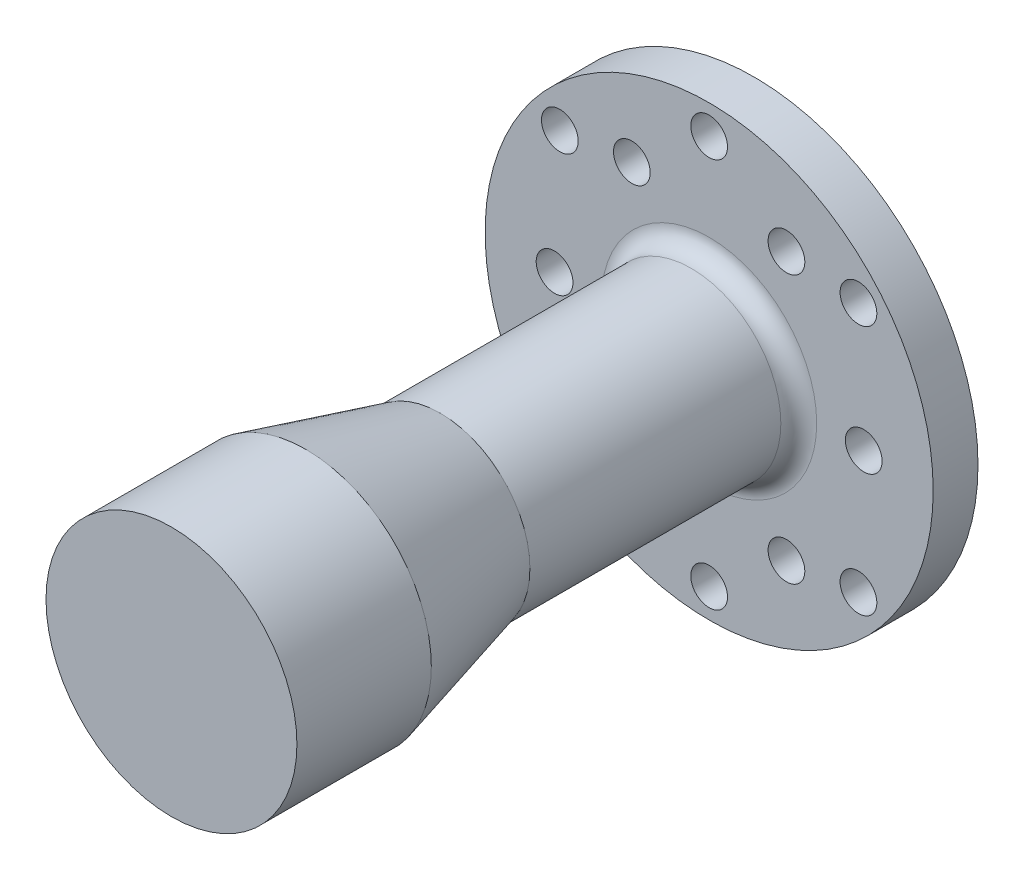
ISO-10303-21;
HEADER;
FILE_DESCRIPTION(('STEP AP214'),'2;1');
FILE_NAME('part.step','',(''),(''),'','','');
FILE_SCHEMA(('AUTOMOTIVE_DESIGN { 1 0 10303 214 1 1 1 1 }'));
ENDSEC;
DATA;
#1=APPLICATION_CONTEXT('core data for automotive mechanical design processes');
#2=APPLICATION_PROTOCOL_DEFINITION('international standard','automotive_design',2000,#1);
#3=PRODUCT_CONTEXT('',#1,'mechanical');
#4=PRODUCT('Part','Part','',(#3));
#5=PRODUCT_RELATED_PRODUCT_CATEGORY('part','',(#4));
#6=PRODUCT_DEFINITION_FORMATION('','',#4);
#7=PRODUCT_DEFINITION_CONTEXT('part definition',#1,'design');
#8=PRODUCT_DEFINITION('design','',#6,#7);
#9=PRODUCT_DEFINITION_SHAPE('','',#8);
#10=(LENGTH_UNIT() NAMED_UNIT(*) SI_UNIT(.MILLI.,.METRE.));
#11=(NAMED_UNIT(*) PLANE_ANGLE_UNIT() SI_UNIT($,.RADIAN.));
#12=(NAMED_UNIT(*) SI_UNIT($,.STERADIAN.) SOLID_ANGLE_UNIT());
#13=UNCERTAINTY_MEASURE_WITH_UNIT(LENGTH_MEASURE(1.E-05),#10,'distance_accuracy_value','');
#14=(GEOMETRIC_REPRESENTATION_CONTEXT(3) GLOBAL_UNCERTAINTY_ASSIGNED_CONTEXT((#13)) GLOBAL_UNIT_ASSIGNED_CONTEXT((#10,
#11,#12)) REPRESENTATION_CONTEXT('',''));
#15=CARTESIAN_POINT('',(0.,0.,0.));
#16=DIRECTION('',(0.,0.,1.));
#17=DIRECTION('',(1.,0.,0.));
#18=AXIS2_PLACEMENT_3D('',#15,#16,#17);
#19=CARTESIAN_POINT('',(0.,0.,65.));
#20=DIRECTION('',(0.,0.,-1.));
#21=DIRECTION('',(-1.,0.,0.));
#22=AXIS2_PLACEMENT_3D('',#19,#20,#21);
#23=CYLINDRICAL_SURFACE('',#22,10.);
#24=CARTESIAN_POINT('',(0.,0.,35.0000000000006));
#25=DIRECTION('',(0.,0.,1.));
#26=DIRECTION('',(1.,0.,0.));
#27=AXIS2_PLACEMENT_3D('',#24,#25,#26);
#28=CIRCLE('',#27,10.);
#29=CARTESIAN_POINT('',(-10.,0.,35.0000000000006));
#30=VERTEX_POINT('',#29);
#31=EDGE_CURVE('E10',#30,#30,#28,.F.);
#32=CARTESIAN_POINT('',(0.,0.,7.));
#33=DIRECTION('',(0.,0.,1.));
#34=DIRECTION('',(1.,0.,0.));
#35=AXIS2_PLACEMENT_3D('',#32,#33,#34);
#36=CIRCLE('',#35,10.);
#37=CARTESIAN_POINT('',(-10.,0.,7.));
#38=VERTEX_POINT('',#37);
#39=EDGE_CURVE('E51',#38,#38,#36,.T.);
#40=CARTESIAN_POINT('',(-10.,0.,35.0000000000006));
#41=CARTESIAN_POINT('',(-10.,0.,34.7083333333339));
#42=CARTESIAN_POINT('',(-10.,0.,34.4166666666673));
#43=CARTESIAN_POINT('',(-10.,0.,33.8333333333339));
#44=CARTESIAN_POINT('',(-10.,0.,33.5416666666672));
#45=CARTESIAN_POINT('',(-10.,0.,32.9583333333339));
#46=CARTESIAN_POINT('',(-10.,0.,32.6666666666672));
#47=CARTESIAN_POINT('',(-10.,0.,32.0833333333339));
#48=CARTESIAN_POINT('',(-10.,0.,31.7916666666672));
#49=CARTESIAN_POINT('',(-10.,0.,31.2083333333339));
#50=CARTESIAN_POINT('',(-10.,0.,30.9166666666672));
#51=CARTESIAN_POINT('',(-10.,0.,30.3333333333338));
#52=CARTESIAN_POINT('',(-10.,0.,30.0416666666672));
#53=CARTESIAN_POINT('',(-10.,0.,29.4583333333338));
#54=CARTESIAN_POINT('',(-10.,0.,29.1666666666671));
#55=CARTESIAN_POINT('',(-10.,0.,28.5833333333338));
#56=CARTESIAN_POINT('',(-10.,0.,28.2916666666671));
#57=CARTESIAN_POINT('',(-10.,0.,27.7083333333338));
#58=CARTESIAN_POINT('',(-10.,0.,27.4166666666671));
#59=CARTESIAN_POINT('',(-10.,0.,26.8333333333338));
#60=CARTESIAN_POINT('',(-10.,0.,26.5416666666671));
#61=CARTESIAN_POINT('',(-10.,0.,25.9583333333337));
#62=CARTESIAN_POINT('',(-10.,0.,25.6666666666671));
#63=CARTESIAN_POINT('',(-10.,0.,25.0833333333337));
#64=CARTESIAN_POINT('',(-10.,0.,24.791666666667));
#65=CARTESIAN_POINT('',(-10.,0.,24.2083333333337));
#66=CARTESIAN_POINT('',(-10.,0.,23.916666666667));
#67=CARTESIAN_POINT('',(-10.,0.,23.3333333333337));
#68=CARTESIAN_POINT('',(-10.,0.,23.041666666667));
#69=CARTESIAN_POINT('',(-10.,0.,22.4583333333337));
#70=CARTESIAN_POINT('',(-10.,0.,22.166666666667));
#71=CARTESIAN_POINT('',(-10.,0.,21.5833333333336));
#72=CARTESIAN_POINT('',(-10.,0.,21.291666666667));
#73=CARTESIAN_POINT('',(-10.,0.,20.7083333333336));
#74=CARTESIAN_POINT('',(-10.,0.,20.416666666667));
#75=CARTESIAN_POINT('',(-10.,0.,19.8333333333336));
#76=CARTESIAN_POINT('',(-10.,0.,19.5416666666669));
#77=CARTESIAN_POINT('',(-10.,0.,18.9583333333336));
#78=CARTESIAN_POINT('',(-10.,0.,18.6666666666669));
#79=CARTESIAN_POINT('',(-10.,0.,18.0833333333336));
#80=CARTESIAN_POINT('',(-10.,0.,17.7916666666669));
#81=CARTESIAN_POINT('',(-10.,0.,17.2083333333336));
#82=CARTESIAN_POINT('',(-10.,0.,16.9166666666669));
#83=CARTESIAN_POINT('',(-10.,0.,16.3333333333335));
#84=CARTESIAN_POINT('',(-10.,0.,16.0416666666669));
#85=CARTESIAN_POINT('',(-10.,0.,15.4583333333335));
#86=CARTESIAN_POINT('',(-10.,0.,15.1666666666668));
#87=CARTESIAN_POINT('',(-10.,0.,14.5833333333335));
#88=CARTESIAN_POINT('',(-10.,0.,14.2916666666668));
#89=CARTESIAN_POINT('',(-10.,0.,13.7083333333335));
#90=CARTESIAN_POINT('',(-10.,0.,13.4166666666668));
#91=CARTESIAN_POINT('',(-10.,0.,12.8333333333335));
#92=CARTESIAN_POINT('',(-10.,0.,12.5416666666668));
#93=CARTESIAN_POINT('',(-10.,0.,11.9583333333334));
#94=CARTESIAN_POINT('',(-10.,0.,11.6666666666668));
#95=CARTESIAN_POINT('',(-10.,0.,11.0833333333334));
#96=CARTESIAN_POINT('',(-10.,0.,10.7916666666667));
#97=CARTESIAN_POINT('',(-10.,0.,10.2083333333334));
#98=CARTESIAN_POINT('',(-10.,0.,9.91666666666673));
#99=CARTESIAN_POINT('',(-10.,0.,9.33333333333338));
#100=CARTESIAN_POINT('',(-10.,0.,9.04166666666671));
#101=CARTESIAN_POINT('',(-10.,0.,8.45833333333336));
#102=CARTESIAN_POINT('',(-10.,0.,8.16666666666669));
#103=CARTESIAN_POINT('',(-10.,0.,7.58333333333334));
#104=CARTESIAN_POINT('',(-10.,0.,7.29166666666667));
#105=CARTESIAN_POINT('',(-10.,0.,7.));
#106=B_SPLINE_CURVE_WITH_KNOTS('',3,(#40,#41,#42,#43,#44,#45,#46,#47,#48,#49,#50,#51,#52,#53,
#54,#55,#56,#57,#58,#59,#60,#61,#62,#63,#64,#65,#66,#67,#68,#69,#70,#71,#72,#73,#74,#75,#76,#77,
#78,#79,#80,#81,#82,#83,#84,#85,#86,#87,#88,#89,#90,#91,#92,#93,#94,#95,#96,#97,#98,#99,#100,
#101,#102,#103,#104,#105),.UNSPECIFIED.,.F.,.F.,(4,2,2,2,2,2,2,2,2,2,2,2,2,2,2,2,2,2,2,2,2,2,2,
2,2,2,2,2,2,2,2,2,4),(0.,0.875000000000022,1.75000000000004,2.62500000000006,3.50000000000007,
4.37500000000009,5.25000000000011,6.12500000000013,7.00000000000015,7.87500000000017,
8.75000000000019,9.62500000000021,10.5000000000002,11.3750000000002,12.2500000000003,
13.1250000000003,14.0000000000003,14.8750000000003,15.7500000000003,16.6250000000004,
17.5000000000004,18.3750000000004,19.2500000000004,20.1250000000004,21.0000000000004,
21.8750000000005,22.7500000000005,23.6250000000005,24.5000000000005,25.3750000000005,
26.2500000000006,27.1250000000006,28.0000000000006),.UNSPECIFIED.);
#107=EDGE_CURVE('BSEAM39',#30,#38,#106,.T.);
#108=ORIENTED_EDGE('',*,*,#31,.T.);
#109=ORIENTED_EDGE('',*,*,#39,.T.);
#110=ORIENTED_EDGE('',*,*,#107,.T.);
#111=ORIENTED_EDGE('',*,*,#107,.F.);
#112=EDGE_LOOP('',(#108,#110,#109,#111));
#113=FACE_BOUND('',#112,.T.);
#114=ADVANCED_FACE('F39',(#113),#23,.T.);
#115=CARTESIAN_POINT('',(0.,0.,5.));
#116=DIRECTION('',(0.,0.,1.));
#117=DIRECTION('',(1.,0.,0.));
#118=AXIS2_PLACEMENT_3D('',#115,#116,#117);
#119=PLANE('',#118);
#120=CARTESIAN_POINT('',(0.,0.,5.));
#121=DIRECTION('',(0.,0.,1.));
#122=DIRECTION('',(1.,0.,0.));
#123=AXIS2_PLACEMENT_3D('',#120,#121,#122);
#124=CIRCLE('',#123,12.);
#125=CARTESIAN_POINT('',(12.,0.,5.));
#126=VERTEX_POINT('',#125);
#127=EDGE_CURVE('E47',#126,#126,#124,.F.);
#128=ORIENTED_EDGE('',*,*,#127,.T.);
#129=EDGE_LOOP('',(#128));
#130=FACE_BOUND('',#129,.T.);
#131=CARTESIAN_POINT('',(-17.25,0.,5.));
#132=DIRECTION('',(0.,0.,1.));
#133=DIRECTION('',(1.,0.,0.));
#134=AXIS2_PLACEMENT_3D('',#131,#132,#133);
#135=CIRCLE('',#134,2.05);
#136=CARTESIAN_POINT('',(-15.2,0.,5.));
#137=VERTEX_POINT('',#136);
#138=EDGE_CURVE('E121',#137,#137,#135,.T.);
#139=ORIENTED_EDGE('',*,*,#138,.F.);
#140=EDGE_LOOP('',(#139));
#141=FACE_BOUND('',#140,.T.);
#142=CARTESIAN_POINT('',(8.62499999999998,-14.9389382152816,5.));
#143=DIRECTION('',(0.,0.,1.));
#144=DIRECTION('',(1.,0.,0.));
#145=AXIS2_PLACEMENT_3D('',#142,#143,#144);
#146=CIRCLE('',#145,2.05);
#147=CARTESIAN_POINT('',(10.675,-14.9389382152816,5.));
#148=VERTEX_POINT('',#147);
#149=EDGE_CURVE('E109',#148,#148,#146,.T.);
#150=ORIENTED_EDGE('',*,*,#149,.F.);
#151=EDGE_LOOP('',(#150));
#152=FACE_BOUND('',#151,.T.);
#153=CARTESIAN_POINT('',(8.62500000000001,14.9389382152816,5.));
#154=DIRECTION('',(0.,0.,1.));
#155=DIRECTION('',(1.,0.,0.));
#156=AXIS2_PLACEMENT_3D('',#153,#154,#155);
#157=CIRCLE('',#156,2.05);
#158=CARTESIAN_POINT('',(10.675,14.9389382152816,5.));
#159=VERTEX_POINT('',#158);
#160=EDGE_CURVE('E97',#159,#159,#157,.T.);
#161=ORIENTED_EDGE('',*,*,#160,.F.);
#162=EDGE_LOOP('',(#161));
#163=FACE_BOUND('',#162,.T.);
#164=CARTESIAN_POINT('',(0.,-21.75,5.));
#165=DIRECTION('',(0.,0.,1.));
#166=DIRECTION('',(-1.,0.,0.));
#167=AXIS2_PLACEMENT_3D('',#164,#165,#166);
#168=CIRCLE('',#167,2.05);
#169=CARTESIAN_POINT('',(-2.05,-21.75,5.));
#170=VERTEX_POINT('',#169);
#171=EDGE_CURVE('E85',#170,#170,#168,.T.);
#172=ORIENTED_EDGE('',*,*,#171,.F.);
#173=EDGE_LOOP('',(#172));
#174=FACE_BOUND('',#173,.T.);
#175=CARTESIAN_POINT('',(-16.6614666378377,13.9806305106823,5.));
#176=DIRECTION('',(0.,0.,1.));
#177=DIRECTION('',(1.,0.,0.));
#178=AXIS2_PLACEMENT_3D('',#175,#176,#177);
#179=CIRCLE('',#178,2.05);
#180=CARTESIAN_POINT('',(-14.6114666378377,13.9806305106823,5.));
#181=VERTEX_POINT('',#180);
#182=EDGE_CURVE('E73',#181,#181,#179,.T.);
#183=ORIENTED_EDGE('',*,*,#182,.F.);
#184=EDGE_LOOP('',(#183));
#185=FACE_BOUND('',#184,.T.);
#186=CARTESIAN_POINT('',(16.6614666378377,13.9806305106823,5.));
#187=DIRECTION('',(0.,0.,1.));
#188=DIRECTION('',(1.,0.,0.));
#189=AXIS2_PLACEMENT_3D('',#186,#187,#188);
#190=CIRCLE('',#189,2.05);
#191=CARTESIAN_POINT('',(18.7114666378377,13.9806305106823,5.));
#192=VERTEX_POINT('',#191);
#193=EDGE_CURVE('E61',#192,#192,#190,.T.);
#194=ORIENTED_EDGE('',*,*,#193,.F.);
#195=EDGE_LOOP('',(#194));
#196=FACE_BOUND('',#195,.T.);
#197=CARTESIAN_POINT('',(0.,0.,5.));
#198=DIRECTION('',(0.,0.,1.));
#199=DIRECTION('',(1.,0.,0.));
#200=AXIS2_PLACEMENT_3D('',#197,#198,#199);
#201=CIRCLE('',#200,25.);
#202=CARTESIAN_POINT('',(25.,0.,5.));
#203=VERTEX_POINT('',#202);
#204=EDGE_CURVE('E55',#203,#203,#201,.T.);
#205=ORIENTED_EDGE('',*,*,#204,.T.);
#206=EDGE_LOOP('',(#205));
#207=FACE_BOUND('',#206,.T.);
#208=CARTESIAN_POINT('',(0.,21.75,5.));
#209=DIRECTION('',(0.,0.,1.));
#210=DIRECTION('',(1.,0.,0.));
#211=AXIS2_PLACEMENT_3D('',#208,#209,#210);
#212=CIRCLE('',#211,2.05);
#213=CARTESIAN_POINT('',(2.05,21.75,5.));
#214=VERTEX_POINT('',#213);
#215=EDGE_CURVE('E67',#214,#214,#212,.T.);
#216=ORIENTED_EDGE('',*,*,#215,.F.);
#217=EDGE_LOOP('',(#216));
#218=FACE_BOUND('',#217,.T.);
#219=CARTESIAN_POINT('',(16.6614666378377,-13.9806305106823,5.));
#220=DIRECTION('',(0.,0.,1.));
#221=DIRECTION('',(-1.,0.,0.));
#222=AXIS2_PLACEMENT_3D('',#219,#220,#221);
#223=CIRCLE('',#222,2.05);
#224=CARTESIAN_POINT('',(14.6114666378377,-13.9806305106823,5.));
#225=VERTEX_POINT('',#224);
#226=EDGE_CURVE('E79',#225,#225,#223,.T.);
#227=ORIENTED_EDGE('',*,*,#226,.F.);
#228=EDGE_LOOP('',(#227));
#229=FACE_BOUND('',#228,.T.);
#230=CARTESIAN_POINT('',(-16.6614666378377,-13.9806305106823,5.));
#231=DIRECTION('',(0.,0.,1.));
#232=DIRECTION('',(-1.,0.,0.));
#233=AXIS2_PLACEMENT_3D('',#230,#231,#232);
#234=CIRCLE('',#233,2.05);
#235=CARTESIAN_POINT('',(-18.7114666378377,-13.9806305106823,5.));
#236=VERTEX_POINT('',#235);
#237=EDGE_CURVE('E91',#236,#236,#234,.T.);
#238=ORIENTED_EDGE('',*,*,#237,.F.);
#239=EDGE_LOOP('',(#238));
#240=FACE_BOUND('',#239,.T.);
#241=CARTESIAN_POINT('',(17.25,0.,5.));
#242=DIRECTION('',(0.,0.,1.));
#243=DIRECTION('',(1.,0.,0.));
#244=AXIS2_PLACEMENT_3D('',#241,#242,#243);
#245=CIRCLE('',#244,2.05);
#246=CARTESIAN_POINT('',(19.3,0.,5.));
#247=VERTEX_POINT('',#246);
#248=EDGE_CURVE('E103',#247,#247,#245,.T.);
#249=ORIENTED_EDGE('',*,*,#248,.F.);
#250=EDGE_LOOP('',(#249));
#251=FACE_BOUND('',#250,.T.);
#252=CARTESIAN_POINT('',(-8.62500000000003,-14.9389382152815,5.));
#253=DIRECTION('',(0.,0.,1.));
#254=DIRECTION('',(1.,0.,0.));
#255=AXIS2_PLACEMENT_3D('',#252,#253,#254);
#256=CIRCLE('',#255,2.05);
#257=CARTESIAN_POINT('',(-6.57500000000003,-14.9389382152815,5.));
#258=VERTEX_POINT('',#257);
#259=EDGE_CURVE('E115',#258,#258,#256,.T.);
#260=ORIENTED_EDGE('',*,*,#259,.F.);
#261=EDGE_LOOP('',(#260));
#262=FACE_BOUND('',#261,.T.);
#263=CARTESIAN_POINT('',(-8.62500000000001,14.9389382152816,5.));
#264=DIRECTION('',(0.,0.,1.));
#265=DIRECTION('',(1.,0.,0.));
#266=AXIS2_PLACEMENT_3D('',#263,#264,#265);
#267=CIRCLE('',#266,2.05);
#268=CARTESIAN_POINT('',(-6.57500000000001,14.9389382152816,5.));
#269=VERTEX_POINT('',#268);
#270=EDGE_CURVE('E127',#269,#269,#267,.T.);
#271=ORIENTED_EDGE('',*,*,#270,.F.);
#272=EDGE_LOOP('',(#271));
#273=FACE_BOUND('',#272,.T.);
#274=ADVANCED_FACE('F154',(#130,#141,#152,#163,#174,#185,#196,#207,#218,#229,#240,#251,#262,
#273),#119,.T.);
#275=CARTESIAN_POINT('',(0.,0.,0.));
#276=DIRECTION('',(0.,0.,1.));
#277=DIRECTION('',(1.,0.,0.));
#278=AXIS2_PLACEMENT_3D('',#275,#276,#277);
#279=PLANE('',#278);
#280=CARTESIAN_POINT('',(0.,0.,0.));
#281=DIRECTION('',(0.,0.,1.));
#282=DIRECTION('',(1.,0.,0.));
#283=AXIS2_PLACEMENT_3D('',#280,#281,#282);
#284=CIRCLE('',#283,25.);
#285=CARTESIAN_POINT('',(25.,0.,0.));
#286=VERTEX_POINT('',#285);
#287=EDGE_CURVE('E58',#286,#286,#284,.T.);
#288=ORIENTED_EDGE('',*,*,#287,.F.);
#289=EDGE_LOOP('',(#288));
#290=FACE_BOUND('',#289,.T.);
#291=CARTESIAN_POINT('',(16.6614666378377,13.9806305106823,0.));
#292=DIRECTION('',(0.,0.,1.));
#293=DIRECTION('',(1.,0.,0.));
#294=AXIS2_PLACEMENT_3D('',#291,#292,#293);
#295=CIRCLE('',#294,2.05);
#296=CARTESIAN_POINT('',(18.7114666378377,13.9806305106823,0.));
#297=VERTEX_POINT('',#296);
#298=EDGE_CURVE('E64',#297,#297,#295,.T.);
#299=ORIENTED_EDGE('',*,*,#298,.T.);
#300=EDGE_LOOP('',(#299));
#301=FACE_BOUND('',#300,.T.);
#302=CARTESIAN_POINT('',(0.,21.75,0.));
#303=DIRECTION('',(0.,0.,1.));
#304=DIRECTION('',(1.,0.,0.));
#305=AXIS2_PLACEMENT_3D('',#302,#303,#304);
#306=CIRCLE('',#305,2.05);
#307=CARTESIAN_POINT('',(2.05,21.75,0.));
#308=VERTEX_POINT('',#307);
#309=EDGE_CURVE('E70',#308,#308,#306,.T.);
#310=ORIENTED_EDGE('',*,*,#309,.T.);
#311=EDGE_LOOP('',(#310));
#312=FACE_BOUND('',#311,.T.);
#313=CARTESIAN_POINT('',(-16.6614666378377,13.9806305106823,0.));
#314=DIRECTION('',(0.,0.,1.));
#315=DIRECTION('',(1.,0.,0.));
#316=AXIS2_PLACEMENT_3D('',#313,#314,#315);
#317=CIRCLE('',#316,2.05);
#318=CARTESIAN_POINT('',(-14.6114666378377,13.9806305106823,0.));
#319=VERTEX_POINT('',#318);
#320=EDGE_CURVE('E76',#319,#319,#317,.T.);
#321=ORIENTED_EDGE('',*,*,#320,.T.);
#322=EDGE_LOOP('',(#321));
#323=FACE_BOUND('',#322,.T.);
#324=CARTESIAN_POINT('',(16.6614666378377,-13.9806305106823,0.));
#325=DIRECTION('',(0.,0.,1.));
#326=DIRECTION('',(-1.,0.,0.));
#327=AXIS2_PLACEMENT_3D('',#324,#325,#326);
#328=CIRCLE('',#327,2.05);
#329=CARTESIAN_POINT('',(14.6114666378377,-13.9806305106823,0.));
#330=VERTEX_POINT('',#329);
#331=EDGE_CURVE('E82',#330,#330,#328,.T.);
#332=ORIENTED_EDGE('',*,*,#331,.T.);
#333=EDGE_LOOP('',(#332));
#334=FACE_BOUND('',#333,.T.);
#335=CARTESIAN_POINT('',(0.,-21.75,0.));
#336=DIRECTION('',(0.,0.,1.));
#337=DIRECTION('',(-1.,0.,0.));
#338=AXIS2_PLACEMENT_3D('',#335,#336,#337);
#339=CIRCLE('',#338,2.05);
#340=CARTESIAN_POINT('',(-2.05,-21.75,0.));
#341=VERTEX_POINT('',#340);
#342=EDGE_CURVE('E88',#341,#341,#339,.T.);
#343=ORIENTED_EDGE('',*,*,#342,.T.);
#344=EDGE_LOOP('',(#343));
#345=FACE_BOUND('',#344,.T.);
#346=CARTESIAN_POINT('',(-16.6614666378377,-13.9806305106823,0.));
#347=DIRECTION('',(0.,0.,1.));
#348=DIRECTION('',(-1.,0.,0.));
#349=AXIS2_PLACEMENT_3D('',#346,#347,#348);
#350=CIRCLE('',#349,2.05);
#351=CARTESIAN_POINT('',(-18.7114666378377,-13.9806305106823,0.));
#352=VERTEX_POINT('',#351);
#353=EDGE_CURVE('E94',#352,#352,#350,.T.);
#354=ORIENTED_EDGE('',*,*,#353,.T.);
#355=EDGE_LOOP('',(#354));
#356=FACE_BOUND('',#355,.T.);
#357=CARTESIAN_POINT('',(8.62500000000001,14.9389382152816,0.));
#358=DIRECTION('',(0.,0.,1.));
#359=DIRECTION('',(1.,0.,0.));
#360=AXIS2_PLACEMENT_3D('',#357,#358,#359);
#361=CIRCLE('',#360,2.05);
#362=CARTESIAN_POINT('',(10.675,14.9389382152816,0.));
#363=VERTEX_POINT('',#362);
#364=EDGE_CURVE('E100',#363,#363,#361,.T.);
#365=ORIENTED_EDGE('',*,*,#364,.T.);
#366=EDGE_LOOP('',(#365));
#367=FACE_BOUND('',#366,.T.);
#368=CARTESIAN_POINT('',(17.25,0.,0.));
#369=DIRECTION('',(0.,0.,1.));
#370=DIRECTION('',(1.,0.,0.));
#371=AXIS2_PLACEMENT_3D('',#368,#369,#370);
#372=CIRCLE('',#371,2.05);
#373=CARTESIAN_POINT('',(19.3,0.,0.));
#374=VERTEX_POINT('',#373);
#375=EDGE_CURVE('E106',#374,#374,#372,.T.);
#376=ORIENTED_EDGE('',*,*,#375,.T.);
#377=EDGE_LOOP('',(#376));
#378=FACE_BOUND('',#377,.T.);
#379=CARTESIAN_POINT('',(8.62499999999998,-14.9389382152816,0.));
#380=DIRECTION('',(0.,0.,1.));
#381=DIRECTION('',(1.,0.,0.));
#382=AXIS2_PLACEMENT_3D('',#379,#380,#381);
#383=CIRCLE('',#382,2.05);
#384=CARTESIAN_POINT('',(10.675,-14.9389382152816,0.));
#385=VERTEX_POINT('',#384);
#386=EDGE_CURVE('E112',#385,#385,#383,.T.);
#387=ORIENTED_EDGE('',*,*,#386,.T.);
#388=EDGE_LOOP('',(#387));
#389=FACE_BOUND('',#388,.T.);
#390=CARTESIAN_POINT('',(-8.62500000000003,-14.9389382152815,0.));
#391=DIRECTION('',(0.,0.,1.));
#392=DIRECTION('',(1.,0.,0.));
#393=AXIS2_PLACEMENT_3D('',#390,#391,#392);
#394=CIRCLE('',#393,2.05);
#395=CARTESIAN_POINT('',(-6.57500000000003,-14.9389382152815,0.));
#396=VERTEX_POINT('',#395);
#397=EDGE_CURVE('E118',#396,#396,#394,.T.);
#398=ORIENTED_EDGE('',*,*,#397,.T.);
#399=EDGE_LOOP('',(#398));
#400=FACE_BOUND('',#399,.T.);
#401=CARTESIAN_POINT('',(-17.25,0.,0.));
#402=DIRECTION('',(0.,0.,1.));
#403=DIRECTION('',(1.,0.,0.));
#404=AXIS2_PLACEMENT_3D('',#401,#402,#403);
#405=CIRCLE('',#404,2.05);
#406=CARTESIAN_POINT('',(-15.2,0.,0.));
#407=VERTEX_POINT('',#406);
#408=EDGE_CURVE('E124',#407,#407,#405,.T.);
#409=ORIENTED_EDGE('',*,*,#408,.T.);
#410=EDGE_LOOP('',(#409));
#411=FACE_BOUND('',#410,.T.);
#412=CARTESIAN_POINT('',(-8.62500000000001,14.9389382152816,0.));
#413=DIRECTION('',(0.,0.,1.));
#414=DIRECTION('',(1.,0.,0.));
#415=AXIS2_PLACEMENT_3D('',#412,#413,#414);
#416=CIRCLE('',#415,2.05);
#417=CARTESIAN_POINT('',(-6.57500000000001,14.9389382152816,0.));
#418=VERTEX_POINT('',#417);
#419=EDGE_CURVE('E130',#418,#418,#416,.T.);
#420=ORIENTED_EDGE('',*,*,#419,.T.);
#421=EDGE_LOOP('',(#420));
#422=FACE_BOUND('',#421,.T.);
#423=ADVANCED_FACE('F160',(#290,#301,#312,#323,#334,#345,#356,#367,#378,#389,#400,#411,#422),
#279,.F.);
#424=CARTESIAN_POINT('',(0.,0.,5.));
#425=DIRECTION('',(0.,0.,-1.));
#426=DIRECTION('',(-1.,0.,0.));
#427=AXIS2_PLACEMENT_3D('',#424,#425,#426);
#428=CYLINDRICAL_SURFACE('',#427,25.);
#429=ORIENTED_EDGE('',*,*,#204,.F.);
#430=EDGE_LOOP('',(#429));
#431=FACE_BOUND('',#430,.T.);
#432=ORIENTED_EDGE('',*,*,#287,.T.);
#433=EDGE_LOOP('',(#432));
#434=FACE_BOUND('',#433,.T.);
#435=ADVANCED_FACE('F212',(#431,#434),#428,.T.);
#436=CARTESIAN_POINT('',(16.6614666378377,13.9806305106823,5.));
#437=DIRECTION('',(0.,0.,-1.));
#438=DIRECTION('',(-1.,0.,0.));
#439=AXIS2_PLACEMENT_3D('',#436,#437,#438);
#440=CYLINDRICAL_SURFACE('',#439,2.05);
#441=ORIENTED_EDGE('',*,*,#193,.T.);
#442=EDGE_LOOP('',(#441));
#443=FACE_BOUND('',#442,.T.);
#444=ORIENTED_EDGE('',*,*,#298,.F.);
#445=EDGE_LOOP('',(#444));
#446=FACE_BOUND('',#445,.T.);
#447=ADVANCED_FACE('F209',(#443,#446),#440,.F.);
#448=CARTESIAN_POINT('',(0.,21.75,5.));
#449=DIRECTION('',(0.,0.,-1.));
#450=DIRECTION('',(-1.,0.,0.));
#451=AXIS2_PLACEMENT_3D('',#448,#449,#450);
#452=CYLINDRICAL_SURFACE('',#451,2.05);
#453=ORIENTED_EDGE('',*,*,#215,.T.);
#454=EDGE_LOOP('',(#453));
#455=FACE_BOUND('',#454,.T.);
#456=ORIENTED_EDGE('',*,*,#309,.F.);
#457=EDGE_LOOP('',(#456));
#458=FACE_BOUND('',#457,.T.);
#459=ADVANCED_FACE('F205',(#455,#458),#452,.F.);
#460=CARTESIAN_POINT('',(-16.6614666378377,13.9806305106823,5.));
#461=DIRECTION('',(0.,0.,-1.));
#462=DIRECTION('',(-1.,0.,0.));
#463=AXIS2_PLACEMENT_3D('',#460,#461,#462);
#464=CYLINDRICAL_SURFACE('',#463,2.05);
#465=ORIENTED_EDGE('',*,*,#182,.T.);
#466=EDGE_LOOP('',(#465));
#467=FACE_BOUND('',#466,.T.);
#468=ORIENTED_EDGE('',*,*,#320,.F.);
#469=EDGE_LOOP('',(#468));
#470=FACE_BOUND('',#469,.T.);
#471=ADVANCED_FACE('F201',(#467,#470),#464,.F.);
#472=CARTESIAN_POINT('',(16.6614666378377,-13.9806305106823,5.));
#473=DIRECTION('',(0.,0.,-1.));
#474=DIRECTION('',(-1.,0.,0.));
#475=AXIS2_PLACEMENT_3D('',#472,#473,#474);
#476=CYLINDRICAL_SURFACE('',#475,2.05);
#477=ORIENTED_EDGE('',*,*,#226,.T.);
#478=EDGE_LOOP('',(#477));
#479=FACE_BOUND('',#478,.T.);
#480=ORIENTED_EDGE('',*,*,#331,.F.);
#481=EDGE_LOOP('',(#480));
#482=FACE_BOUND('',#481,.T.);
#483=ADVANCED_FACE('F197',(#479,#482),#476,.F.);
#484=CARTESIAN_POINT('',(0.,-21.75,5.));
#485=DIRECTION('',(0.,0.,-1.));
#486=DIRECTION('',(-1.,0.,0.));
#487=AXIS2_PLACEMENT_3D('',#484,#485,#486);
#488=CYLINDRICAL_SURFACE('',#487,2.05);
#489=ORIENTED_EDGE('',*,*,#171,.T.);
#490=EDGE_LOOP('',(#489));
#491=FACE_BOUND('',#490,.T.);
#492=ORIENTED_EDGE('',*,*,#342,.F.);
#493=EDGE_LOOP('',(#492));
#494=FACE_BOUND('',#493,.T.);
#495=ADVANCED_FACE('F193',(#491,#494),#488,.F.);
#496=CARTESIAN_POINT('',(-16.6614666378377,-13.9806305106823,5.));
#497=DIRECTION('',(0.,0.,-1.));
#498=DIRECTION('',(-1.,0.,0.));
#499=AXIS2_PLACEMENT_3D('',#496,#497,#498);
#500=CYLINDRICAL_SURFACE('',#499,2.05);
#501=ORIENTED_EDGE('',*,*,#237,.T.);
#502=EDGE_LOOP('',(#501));
#503=FACE_BOUND('',#502,.T.);
#504=ORIENTED_EDGE('',*,*,#353,.F.);
#505=EDGE_LOOP('',(#504));
#506=FACE_BOUND('',#505,.T.);
#507=ADVANCED_FACE('F189',(#503,#506),#500,.F.);
#508=CARTESIAN_POINT('',(8.62500000000001,14.9389382152816,5.));
#509=DIRECTION('',(0.,0.,-1.));
#510=DIRECTION('',(-1.,0.,0.));
#511=AXIS2_PLACEMENT_3D('',#508,#509,#510);
#512=CYLINDRICAL_SURFACE('',#511,2.05);
#513=ORIENTED_EDGE('',*,*,#160,.T.);
#514=EDGE_LOOP('',(#513));
#515=FACE_BOUND('',#514,.T.);
#516=ORIENTED_EDGE('',*,*,#364,.F.);
#517=EDGE_LOOP('',(#516));
#518=FACE_BOUND('',#517,.T.);
#519=ADVANCED_FACE('F185',(#515,#518),#512,.F.);
#520=CARTESIAN_POINT('',(17.25,0.,5.));
#521=DIRECTION('',(0.,0.,-1.));
#522=DIRECTION('',(-1.,0.,0.));
#523=AXIS2_PLACEMENT_3D('',#520,#521,#522);
#524=CYLINDRICAL_SURFACE('',#523,2.05);
#525=ORIENTED_EDGE('',*,*,#248,.T.);
#526=EDGE_LOOP('',(#525));
#527=FACE_BOUND('',#526,.T.);
#528=ORIENTED_EDGE('',*,*,#375,.F.);
#529=EDGE_LOOP('',(#528));
#530=FACE_BOUND('',#529,.T.);
#531=ADVANCED_FACE('F181',(#527,#530),#524,.F.);
#532=CARTESIAN_POINT('',(8.62499999999998,-14.9389382152816,5.));
#533=DIRECTION('',(0.,0.,-1.));
#534=DIRECTION('',(-1.,0.,0.));
#535=AXIS2_PLACEMENT_3D('',#532,#533,#534);
#536=CYLINDRICAL_SURFACE('',#535,2.05);
#537=ORIENTED_EDGE('',*,*,#149,.T.);
#538=EDGE_LOOP('',(#537));
#539=FACE_BOUND('',#538,.T.);
#540=ORIENTED_EDGE('',*,*,#386,.F.);
#541=EDGE_LOOP('',(#540));
#542=FACE_BOUND('',#541,.T.);
#543=ADVANCED_FACE('F177',(#539,#542),#536,.F.);
#544=CARTESIAN_POINT('',(-8.62500000000003,-14.9389382152815,5.));
#545=DIRECTION('',(0.,0.,-1.));
#546=DIRECTION('',(-1.,0.,0.));
#547=AXIS2_PLACEMENT_3D('',#544,#545,#546);
#548=CYLINDRICAL_SURFACE('',#547,2.05);
#549=ORIENTED_EDGE('',*,*,#259,.T.);
#550=EDGE_LOOP('',(#549));
#551=FACE_BOUND('',#550,.T.);
#552=ORIENTED_EDGE('',*,*,#397,.F.);
#553=EDGE_LOOP('',(#552));
#554=FACE_BOUND('',#553,.T.);
#555=ADVANCED_FACE('F173',(#551,#554),#548,.F.);
#556=CARTESIAN_POINT('',(-17.25,0.,5.));
#557=DIRECTION('',(0.,0.,-1.));
#558=DIRECTION('',(-1.,0.,0.));
#559=AXIS2_PLACEMENT_3D('',#556,#557,#558);
#560=CYLINDRICAL_SURFACE('',#559,2.05);
#561=ORIENTED_EDGE('',*,*,#138,.T.);
#562=EDGE_LOOP('',(#561));
#563=FACE_BOUND('',#562,.T.);
#564=ORIENTED_EDGE('',*,*,#408,.F.);
#565=EDGE_LOOP('',(#564));
#566=FACE_BOUND('',#565,.T.);
#567=ADVANCED_FACE('F169',(#563,#566),#560,.F.);
#568=CARTESIAN_POINT('',(-8.62500000000001,14.9389382152816,5.));
#569=DIRECTION('',(0.,0.,-1.));
#570=DIRECTION('',(-1.,0.,0.));
#571=AXIS2_PLACEMENT_3D('',#568,#569,#570);
#572=CYLINDRICAL_SURFACE('',#571,2.05);
#573=ORIENTED_EDGE('',*,*,#270,.T.);
#574=EDGE_LOOP('',(#573));
#575=FACE_BOUND('',#574,.T.);
#576=ORIENTED_EDGE('',*,*,#419,.F.);
#577=EDGE_LOOP('',(#576));
#578=FACE_BOUND('',#577,.T.);
#579=ADVANCED_FACE('F165',(#575,#578),#572,.F.);
#580=CARTESIAN_POINT('',(0.,0.,7.));
#581=DIRECTION('',(0.,0.,1.));
#582=DIRECTION('',(1.,0.,0.));
#583=AXIS2_PLACEMENT_3D('',#580,#581,#582);
#584=TOROIDAL_SURFACE('',#583,12.,2.);
#585=ORIENTED_EDGE('',*,*,#127,.F.);
#586=EDGE_LOOP('',(#585));
#587=FACE_BOUND('',#586,.T.);
#588=ORIENTED_EDGE('',*,*,#39,.F.);
#589=EDGE_LOOP('',(#588));
#590=FACE_BOUND('',#589,.T.);
#591=ADVANCED_FACE('F168',(#587,#590),#584,.F.);
#592=CARTESIAN_POINT('',(0.,0.,50.));
#593=DIRECTION('',(0.,0.,1.));
#594=DIRECTION('',(1.,0.,0.));
#595=AXIS2_PLACEMENT_3D('',#592,#593,#594);
#596=CYLINDRICAL_SURFACE('',#595,14.);
#597=CARTESIAN_POINT('',(0.,0.,50.));
#598=DIRECTION('',(0.,0.,1.));
#599=DIRECTION('',(1.,0.,0.));
#600=AXIS2_PLACEMENT_3D('',#597,#598,#599);
#601=CIRCLE('',#600,14.);
#602=CARTESIAN_POINT('',(14.,0.,50.));
#603=VERTEX_POINT('',#602);
#604=EDGE_CURVE('E133',#603,#603,#601,.T.);
#605=ORIENTED_EDGE('',*,*,#604,.T.);
#606=EDGE_LOOP('',(#605));
#607=FACE_BOUND('',#606,.T.);
#608=CARTESIAN_POINT('',(0.,0.,65.));
#609=DIRECTION('',(0.,0.,1.));
#610=DIRECTION('',(1.,0.,0.));
#611=AXIS2_PLACEMENT_3D('',#608,#609,#610);
#612=CIRCLE('',#611,14.);
#613=CARTESIAN_POINT('',(14.,0.,65.));
#614=VERTEX_POINT('',#613);
#615=EDGE_CURVE('E136',#614,#614,#612,.T.);
#616=ORIENTED_EDGE('',*,*,#615,.F.);
#617=EDGE_LOOP('',(#616));
#618=FACE_BOUND('',#617,.T.);
#619=ADVANCED_FACE('F142',(#607,#618),#596,.T.);
#620=CARTESIAN_POINT('',(0.,0.,65.));
#621=DIRECTION('',(0.,0.,1.));
#622=DIRECTION('',(1.,0.,0.));
#623=AXIS2_PLACEMENT_3D('',#620,#621,#622);
#624=PLANE('',#623);
#625=ORIENTED_EDGE('',*,*,#615,.T.);
#626=EDGE_LOOP('',(#625));
#627=FACE_BOUND('',#626,.T.);
#628=ADVANCED_FACE('F146',(#627),#624,.T.);
#629=CARTESIAN_POINT('',(0.,0.,50.));
#630=DIRECTION('',(0.,0.,1.));
#631=DIRECTION('',(1.,0.,0.));
#632=AXIS2_PLACEMENT_3D('',#629,#630,#631);
#633=CONICAL_SURFACE('',#632,13.9999999999999,0.260602391747344);
#634=ORIENTED_EDGE('',*,*,#31,.F.);
#635=EDGE_LOOP('',(#634));
#636=FACE_BOUND('',#635,.T.);
#637=ORIENTED_EDGE('',*,*,#604,.F.);
#638=EDGE_LOOP('',(#637));
#639=FACE_BOUND('',#638,.T.);
#640=ADVANCED_FACE('F42',(#636,#639),#633,.T.);
#641=CLOSED_SHELL('',(#114,#274,#423,#435,#447,#459,#471,#483,#495,#507,#519,#531,#543,#555,
#567,#579,#591,#619,#628,#640));
#642=MANIFOLD_SOLID_BREP('B2',#641);
#643=ADVANCED_BREP_SHAPE_REPRESENTATION('',(#18,#642),#14);
#644=SHAPE_DEFINITION_REPRESENTATION(#9,#643);
ENDSEC;
END-ISO-10303-21;
